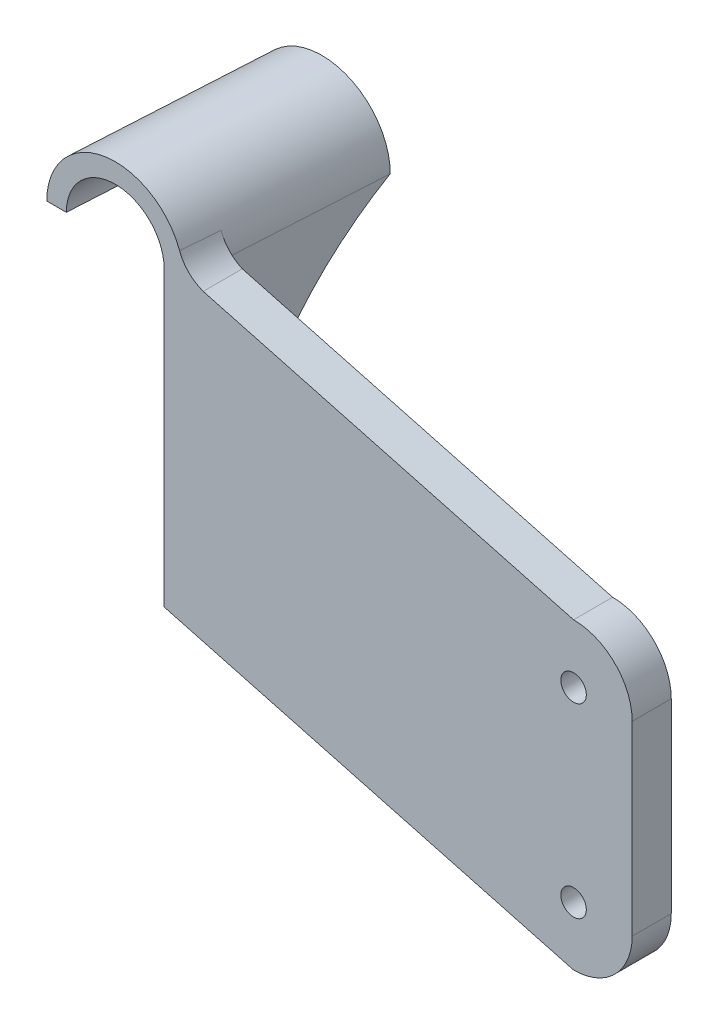
ISO-10303-21;
HEADER;
FILE_DESCRIPTION(('STEP AP214'),'2;1');
FILE_NAME('part.step','',(''),(''),'','','');
FILE_SCHEMA(('AUTOMOTIVE_DESIGN { 1 0 10303 214 1 1 1 1 }'));
ENDSEC;
DATA;
#1=APPLICATION_CONTEXT('core data for automotive mechanical design processes');
#2=APPLICATION_PROTOCOL_DEFINITION('international standard','automotive_design',2000,#1);
#3=PRODUCT_CONTEXT('',#1,'mechanical');
#4=PRODUCT('Part','Part','',(#3));
#5=PRODUCT_RELATED_PRODUCT_CATEGORY('part','',(#4));
#6=PRODUCT_DEFINITION_FORMATION('','',#4);
#7=PRODUCT_DEFINITION_CONTEXT('part definition',#1,'design');
#8=PRODUCT_DEFINITION('design','',#6,#7);
#9=PRODUCT_DEFINITION_SHAPE('','',#8);
#10=(LENGTH_UNIT() NAMED_UNIT(*) SI_UNIT(.MILLI.,.METRE.));
#11=(NAMED_UNIT(*) PLANE_ANGLE_UNIT() SI_UNIT($,.RADIAN.));
#12=(NAMED_UNIT(*) SI_UNIT($,.STERADIAN.) SOLID_ANGLE_UNIT());
#13=UNCERTAINTY_MEASURE_WITH_UNIT(LENGTH_MEASURE(1.E-05),#10,'distance_accuracy_value','');
#14=(GEOMETRIC_REPRESENTATION_CONTEXT(3) GLOBAL_UNCERTAINTY_ASSIGNED_CONTEXT((#13)) GLOBAL_UNIT_ASSIGNED_CONTEXT((#10,
#11,#12)) REPRESENTATION_CONTEXT('',''));
#15=CARTESIAN_POINT('',(0.,0.,0.));
#16=DIRECTION('',(0.,0.,1.));
#17=DIRECTION('',(1.,0.,0.));
#18=AXIS2_PLACEMENT_3D('',#15,#16,#17);
#19=CARTESIAN_POINT('',(0.,0.,0.));
#20=DIRECTION('',(0.,0.,1.));
#21=DIRECTION('',(1.,0.,0.));
#22=AXIS2_PLACEMENT_3D('',#19,#20,#21);
#23=PLANE('',#22);
#24=CARTESIAN_POINT('',(-15.,-23.8125,0.));
#25=DIRECTION('',(0.,0.,1.));
#26=DIRECTION('',(1.,0.,0.));
#27=AXIS2_PLACEMENT_3D('',#24,#25,#26);
#28=CIRCLE('',#27,3.2639);
#29=CARTESIAN_POINT('',(-11.7361,-23.8125,0.));
#30=VERTEX_POINT('',#29);
#31=EDGE_CURVE('E240',#30,#30,#28,.F.);
#32=ORIENTED_EDGE('',*,*,#31,.F.);
#33=EDGE_LOOP('',(#32));
#34=FACE_BOUND('',#33,.T.);
#35=CARTESIAN_POINT('',(-15.,23.8125,0.));
#36=DIRECTION('',(0.,0.,1.));
#37=DIRECTION('',(1.,0.,0.));
#38=AXIS2_PLACEMENT_3D('',#35,#36,#37);
#39=CIRCLE('',#38,3.2639);
#40=CARTESIAN_POINT('',(-11.7361,23.8125,0.));
#41=VERTEX_POINT('',#40);
#42=EDGE_CURVE('E268',#41,#41,#39,.T.);
#43=ORIENTED_EDGE('',*,*,#42,.T.);
#44=EDGE_LOOP('',(#43));
#45=FACE_BOUND('',#44,.T.);
#46=DIRECTION('',(0.,1.,0.));
#47=VECTOR('',#46,1.);
#48=CARTESIAN_POINT('',(-114.198978093451,-53.2440936926434,0.));
#49=LINE('',#48,#47);
#50=CARTESIAN_POINT('',(-114.198978093451,-12.2322139298705,0.));
#51=VERTEX_POINT('',#50);
#52=CARTESIAN_POINT('',(-114.198978093451,-9.1224517524588,0.));
#53=VERTEX_POINT('',#52);
#54=EDGE_CURVE('E182',#51,#53,#49,.T.);
#55=ORIENTED_EDGE('',*,*,#54,.T.);
#56=CARTESIAN_POINT('',(-114.198978093451,64.2083159442407,0.));
#57=VERTEX_POINT('',#56);
#58=EDGE_CURVE('E196',#53,#57,#49,.T.);
#59=ORIENTED_EDGE('',*,*,#58,.T.);
#60=CARTESIAN_POINT('',(-131.72751770729,64.2083159442407,0.));
#61=DIRECTION('',(0.,0.,1.));
#62=DIRECTION('',(-1.,0.,0.));
#63=AXIS2_PLACEMENT_3D('',#60,#61,#62);
#64=ELLIPSE('',#63,17.5285396138397,17.5);
#65=CARTESIAN_POINT('',(-115.202236813019,70.0438647685337,0.));
#66=VERTEX_POINT('',#65);
#67=EDGE_CURVE('E103',#66,#57,#64,.F.);
#68=ORIENTED_EDGE('',*,*,#67,.F.);
#69=CARTESIAN_POINT('',(-116.766052143577,70.3934678805941,25.1294023386461));
#70=CARTESIAN_POINT('',(-114.90583972174,65.4489533344291,25.3216426303527));
#71=CARTESIAN_POINT('',(-109.778475403574,64.2083159442407,25.6629997691564));
#72=CARTESIAN_POINT('',(-116.66491568588,70.377357883688,23.4659424467528));
#73=CARTESIAN_POINT('',(-114.831989143142,65.4893471285427,23.664285742457));
#74=CARTESIAN_POINT('',(-109.778475403574,64.2083159442407,23.9997382471047));
#75=CARTESIAN_POINT('',(-116.563339357471,70.360009460471,21.802541514051));
#76=CARTESIAN_POINT('',(-114.757622786703,65.5283220216384,22.0025928008072));
#77=CARTESIAN_POINT('',(-109.778475403574,64.2083159442407,22.336550108114));
#78=CARTESIAN_POINT('',(-116.359273757942,70.322660467848,18.4758729858612));
#79=CARTESIAN_POINT('',(-114.608224110674,65.6031364219687,18.679450362724));
#80=CARTESIAN_POINT('',(-109.778475403574,64.2083159442407,19.0103371241911));
#81=CARTESIAN_POINT('',(-116.256784485736,70.3026598952825,16.8126053905344));
#82=CARTESIAN_POINT('',(-114.533187651559,65.6389953145911,17.0178336438794));
#83=CARTESIAN_POINT('',(-109.778475403574,64.2083159442407,17.3473122794558));
#84=CARTESIAN_POINT('',(-115.947907106273,70.2384190068275,11.8231817802251));
#85=CARTESIAN_POINT('',(-114.307599852585,65.7415402474603,12.0456433147462));
#86=CARTESIAN_POINT('',(-109.778475403574,64.2083159442407,12.3586634958358));
#87=CARTESIAN_POINT('',(-115.740100314983,70.1899380979417,8.49725481725506));
#88=CARTESIAN_POINT('',(-114.155438690391,65.8038104631074,8.7223430488615));
#89=CARTESIAN_POINT('',(-109.778475403574,64.2083159442407,9.03331520158085));
#90=CARTESIAN_POINT('',(-115.320415583674,70.079878430995,1.84617846887328));
#91=CARTESIAN_POINT('',(-113.848163464536,65.914855266847,2.07762500042309));
#92=CARTESIAN_POINT('',(-109.778475403574,64.2083159442407,2.38353011946709));
#93=CARTESIAN_POINT('',(-115.108537593924,70.0182995128474,-1.47897090653729));
#94=CARTESIAN_POINT('',(-113.693020250072,65.9637736605168,-1.24502475761192));
#95=CARTESIAN_POINT('',(-109.778475403574,64.2083159442407,-0.940906656753593));
#96=CARTESIAN_POINT('',(-114.787431207845,69.9142746202379,-6.4659182219596));
#97=CARTESIAN_POINT('',(-113.457403421985,66.0263332277125,-6.23831757967811));
#98=CARTESIAN_POINT('',(-109.778475403574,64.2083159442407,-5.92667658565525));
#99=CARTESIAN_POINT('',(-114.679845092063,69.8776559629821,-8.12814135631387));
#100=CARTESIAN_POINT('',(-113.378632185065,66.045341914572,-7.89908801186984));
#101=CARTESIAN_POINT('',(-109.778475403574,64.2083159442407,-7.58848916624825));
#102=CARTESIAN_POINT('',(-114.46353560071,69.8001233123855,-11.452257768302));
#103=CARTESIAN_POINT('',(-113.220260350629,66.0795208521239,-11.2201863646433));
#104=CARTESIAN_POINT('',(-109.778475403574,64.2083159442407,-10.9117468487779));
#105=CARTESIAN_POINT('',(-114.35481222144,69.7592093050731,-13.1141510448453));
#106=CARTESIAN_POINT('',(-113.140656536688,66.0947088612405,-12.8806574873745));
#107=CARTESIAN_POINT('',(-109.778475403574,64.2083159442407,-12.5731919495016));
#108=CARTESIAN_POINT('',(-114.245499421827,69.7159427404333,-14.7758508051952));
#109=CARTESIAN_POINT('',(-113.060456799944,66.1079038082248,-14.5443255332637));
#110=CARTESIAN_POINT('',(-109.778475403574,64.2083159442407,-14.2344239933561));
#111=(BOUNDED_SURFACE() B_SPLINE_SURFACE(3,2,((#69,#70,#71),(#72,#73,#74),(#75,#76,#77),(#78,
#79,#80),(#81,#82,#83),(#84,#85,#86),(#87,#88,#89),(#90,#91,#92),(#93,#94,#95),(#96,#97,#98),
(#99,#100,#101),(#102,#103,#104),(#105,#106,#107),(#108,#109,#110)),.UNSPECIFIED.,.F.,.F.,
.F.) B_SPLINE_SURFACE_WITH_KNOTS((4,2,2,2,2,2,4),(3,3),(0.,5.00021829313843,10.0004425433833,
20.0004397944228,30.0005592747061,35.0008405975528,40.0011381852948),(0.,1.),
.UNSPECIFIED.) GEOMETRIC_REPRESENTATION_ITEM() RATIONAL_B_SPLINE_SURFACE(((1.,0.884071462904654,
1.),(1.,0.886351297895183,1.),(1.,0.888608283563405,1.),(1.,0.89307753883121,1.),(1.,
0.895289808377516,1.),(1.,0.901860810961567,1.),(1.,0.906153943513278,1.),(1.,0.914572416122216,
1.),(1.,0.918697754127885,1.),(1.,0.924764693748891,1.),(1.,0.926766872077972,1.),(1.,
0.930731559444101,1.),(1.,0.932694068352093,1.),(1.,0.934637096018605,1.))) REPRESENTATION_ITEM('') SURFACE());
#112=CARTESIAN_POINT('',(-115.202236813019,70.0438647685337,0.));
#113=CARTESIAN_POINT('',(-115.108132982728,69.7781646984082,0.));
#114=CARTESIAN_POINT('',(-115.002755626731,69.5164646709673,0.));
#115=CARTESIAN_POINT('',(-114.770340667487,69.0028740436337,0.));
#116=CARTESIAN_POINT('',(-114.643303657801,68.7509831751628,0.));
#117=CARTESIAN_POINT('',(-114.368416159062,68.2587431651938,0.));
#118=CARTESIAN_POINT('',(-114.220560410257,68.0183969610417,0.));
#119=CARTESIAN_POINT('',(-113.90514638744,67.5510156357587,0.));
#120=CARTESIAN_POINT('',(-113.737588937366,67.3239799585665,0.));
#121=CARTESIAN_POINT('',(-113.383837064143,66.8846813899946,0.));
#122=CARTESIAN_POINT('',(-113.19763059241,66.6724282012197,0.));
#123=CARTESIAN_POINT('',(-112.80801718424,66.2643435079565,0.));
#124=CARTESIAN_POINT('',(-112.604610260098,66.0685119917303,0.));
#125=CARTESIAN_POINT('',(-112.182348371897,65.6949339322396,0.));
#126=CARTESIAN_POINT('',(-111.963516266534,65.5171615432337,0.));
#127=CARTESIAN_POINT('',(-111.511784692074,65.1806781699171,0.));
#128=CARTESIAN_POINT('',(-111.278891067782,65.0219593466787,0.));
#129=CARTESIAN_POINT('',(-110.837619076165,64.7476562559938,0.));
#130=CARTESIAN_POINT('',(-110.631020585502,64.6291973896918,0.));
#131=CARTESIAN_POINT('',(-110.21023628918,64.4073709349515,0.));
#132=CARTESIAN_POINT('',(-109.996061256318,64.3039829111614,0.));
#133=CARTESIAN_POINT('',(-109.778475403574,64.2083159442407,0.));
#134=B_SPLINE_CURVE_WITH_KNOTS('',3,(#112,#113,#114,#115,#116,#117,#118,#119,#120,#121,#122,
#123,#124,#125,#126,#127,#128,#129,#130,#131,#132,#133),.UNSPECIFIED.,.F.,.F.,(4,2,2,2,2,2,2,2,
2,2,4),(0.,0.845356906713638,1.69069065095905,2.53623834909512,3.38175069837819,
4.22781287598424,5.07387444883638,5.91870757733214,6.76319192865767,7.47705665536603,
8.18994422678877),.UNSPECIFIED.);
#135=CARTESIAN_POINT('',(-109.778475403574,64.2083159442407,0.));
#136=VERTEX_POINT('',#135);
#137=EDGE_CURVE('E12',#66,#136,#134,.T.);
#138=ORIENTED_EDGE('',*,*,#137,.T.);
#139=DIRECTION('',(-0.965925826289068,0.258819045102521,0.));
#140=VECTOR('',#139,1.);
#141=CARTESIAN_POINT('',(8.6983155283833,32.4625554921917,0.));
#142=LINE('',#141,#140);
#143=CARTESIAN_POINT('',(-15.,38.8125,0.));
#144=VERTEX_POINT('',#143);
#145=EDGE_CURVE('E264',#144,#136,#142,.T.);
#146=ORIENTED_EDGE('',*,*,#145,.F.);
#147=CARTESIAN_POINT('',(-15.,23.8125,0.));
#148=DIRECTION('',(0.,0.,1.));
#149=DIRECTION('',(1.,0.,0.));
#150=AXIS2_PLACEMENT_3D('',#147,#148,#149);
#151=CIRCLE('',#150,15.);
#152=CARTESIAN_POINT('',(0.,23.8125,0.));
#153=VERTEX_POINT('',#152);
#154=EDGE_CURVE('E262',#153,#144,#151,.T.);
#155=ORIENTED_EDGE('',*,*,#154,.F.);
#156=DIRECTION('',(0.,1.,0.));
#157=VECTOR('',#156,1.);
#158=CARTESIAN_POINT('',(0.,0.,0.));
#159=LINE('',#158,#157);
#160=CARTESIAN_POINT('',(0.,-23.8125,0.));
#161=VERTEX_POINT('',#160);
#162=EDGE_CURVE('E260',#161,#153,#159,.T.);
#163=ORIENTED_EDGE('',*,*,#162,.F.);
#164=CARTESIAN_POINT('',(-15.,-23.8125,0.));
#165=DIRECTION('',(0.,0.,1.));
#166=DIRECTION('',(1.,0.,0.));
#167=AXIS2_PLACEMENT_3D('',#164,#165,#166);
#168=CIRCLE('',#167,15.);
#169=CARTESIAN_POINT('',(-15.,-38.8125,0.));
#170=VERTEX_POINT('',#169);
#171=EDGE_CURVE('E235',#161,#170,#168,.F.);
#172=ORIENTED_EDGE('',*,*,#171,.T.);
#173=DIRECTION('',(-0.965925826289068,0.258819045102521,0.));
#174=VECTOR('',#173,1.);
#175=CARTESIAN_POINT('',(-10.7079344716167,-39.9625554921918,0.));
#176=LINE('',#175,#174);
#177=EDGE_CURVE('E203',#170,#51,#176,.T.);
#178=ORIENTED_EDGE('',*,*,#177,.T.);
#179=EDGE_LOOP('',(#55,#59,#68,#138,#146,#155,#163,#172,#178));
#180=FACE_BOUND('',#179,.T.);
#181=ADVANCED_FACE('F84',(#34,#45,#180),#23,.F.);
#182=CARTESIAN_POINT('',(0.,0.,10.));
#183=DIRECTION('',(0.,0.,1.));
#184=DIRECTION('',(1.,0.,0.));
#185=AXIS2_PLACEMENT_3D('',#182,#183,#184);
#186=PLANE('',#185);
#187=CARTESIAN_POINT('',(-132.298860842031,64.2083159442407,10.));
#188=DIRECTION('',(0.,0.,1.));
#189=DIRECTION('',(-1.,0.,0.));
#190=AXIS2_PLACEMENT_3D('',#187,#188,#189);
#191=ELLIPSE('',#190,12.5203854384569,12.5);
#192=CARTESIAN_POINT('',(-119.778475403574,64.2083159442407,9.99999999999976));
#193=VERTEX_POINT('',#192);
#194=CARTESIAN_POINT('',(-144.819246280488,64.2083159442407,9.99999999999999));
#195=VERTEX_POINT('',#194);
#196=EDGE_CURVE('E218',#193,#195,#191,.T.);
#197=ORIENTED_EDGE('',*,*,#196,.F.);
#198=DIRECTION('',(0.,1.,0.));
#199=VECTOR('',#198,1.);
#200=CARTESIAN_POINT('',(-119.778475403574,0.,10.));
#201=LINE('',#200,#199);
#202=CARTESIAN_POINT('',(-119.778475403574,-10.737192131448,9.99999999999976));
#203=VERTEX_POINT('',#202);
#204=EDGE_CURVE('E246',#203,#193,#201,.T.);
#205=ORIENTED_EDGE('',*,*,#204,.F.);
#206=DIRECTION('',(-0.965925826289068,0.258819045102521,0.));
#207=VECTOR('',#206,1.);
#208=CARTESIAN_POINT('',(-10.7079344716167,-39.9625554921918,10.));
#209=LINE('',#208,#207);
#210=CARTESIAN_POINT('',(-15.,-38.8125,10.));
#211=VERTEX_POINT('',#210);
#212=EDGE_CURVE('E249',#211,#203,#209,.T.);
#213=ORIENTED_EDGE('',*,*,#212,.F.);
#214=CARTESIAN_POINT('',(-15.,-23.8125,10.));
#215=DIRECTION('',(0.,0.,1.));
#216=DIRECTION('',(1.,0.,0.));
#217=AXIS2_PLACEMENT_3D('',#214,#215,#216);
#218=CIRCLE('',#217,15.);
#219=CARTESIAN_POINT('',(0.,-23.8125,10.));
#220=VERTEX_POINT('',#219);
#221=EDGE_CURVE('E236',#220,#211,#218,.F.);
#222=ORIENTED_EDGE('',*,*,#221,.F.);
#223=DIRECTION('',(0.,1.,0.));
#224=VECTOR('',#223,1.);
#225=CARTESIAN_POINT('',(0.,0.,10.));
#226=LINE('',#225,#224);
#227=CARTESIAN_POINT('',(0.,23.8125,10.));
#228=VERTEX_POINT('',#227);
#229=EDGE_CURVE('E239',#220,#228,#226,.T.);
#230=ORIENTED_EDGE('',*,*,#229,.T.);
#231=CARTESIAN_POINT('',(-15.,23.8125,10.));
#232=DIRECTION('',(0.,0.,1.));
#233=DIRECTION('',(1.,0.,0.));
#234=AXIS2_PLACEMENT_3D('',#231,#232,#233);
#235=CIRCLE('',#234,15.);
#236=CARTESIAN_POINT('',(-15.,38.8125,10.));
#237=VERTEX_POINT('',#236);
#238=EDGE_CURVE('E242',#228,#237,#235,.T.);
#239=ORIENTED_EDGE('',*,*,#238,.T.);
#240=DIRECTION('',(-0.965925826289068,0.258819045102521,0.));
#241=VECTOR('',#240,1.);
#242=CARTESIAN_POINT('',(8.6983155283833,32.4625554921917,10.));
#243=LINE('',#242,#241);
#244=CARTESIAN_POINT('',(-109.778475403574,64.2083159442407,10.));
#245=VERTEX_POINT('',#244);
#246=EDGE_CURVE('E244',#237,#245,#243,.T.);
#247=ORIENTED_EDGE('',*,*,#246,.T.);
#248=CARTESIAN_POINT('',(-109.778475403574,64.2083159442407,10.));
#249=CARTESIAN_POINT('',(-110.04446235349,64.3031228434152,10.));
#250=CARTESIAN_POINT('',(-110.306429598982,64.4091923337721,10.));
#251=CARTESIAN_POINT('',(-110.82051056026,64.6429850482996,10.));
#252=CARTESIAN_POINT('',(-111.072624483562,64.7707078161386,10.));
#253=CARTESIAN_POINT('',(-111.565134770727,65.046905345347,10.));
#254=CARTESIAN_POINT('',(-111.80553403408,65.1953749361277,10.));
#255=CARTESIAN_POINT('',(-112.272969988109,65.5120217924653,10.));
#256=CARTESIAN_POINT('',(-112.500007155843,65.6801983537925,10.));
#257=CARTESIAN_POINT('',(-112.939272744247,66.0352238648214,10.));
#258=CARTESIAN_POINT('',(-113.151489549661,66.2220871871793,10.));
#259=CARTESIAN_POINT('',(-113.559408660405,66.6130430774603,10.));
#260=CARTESIAN_POINT('',(-113.755110934637,66.8171356778259,10.));
#261=CARTESIAN_POINT('',(-114.128411461639,67.2409063891312,10.));
#262=CARTESIAN_POINT('',(-114.306027438163,67.4605688770795,10.));
#263=CARTESIAN_POINT('',(-114.642040428866,67.9139999385939,10.));
#264=CARTESIAN_POINT('',(-114.800442959505,68.1477644342672,10.));
#265=CARTESIAN_POINT('',(-115.126533478059,68.6757482837888,10.));
#266=CARTESIAN_POINT('',(-115.289786240726,68.9727347003004,10.));
#267=CARTESIAN_POINT('',(-115.511366398438,69.4291748212543,10.));
#268=CARTESIAN_POINT('',(-115.581323699089,69.5830947465783,10.));
#269=CARTESIAN_POINT('',(-115.713355383002,69.8942746293057,10.));
#270=CARTESIAN_POINT('',(-115.775429966112,70.0515345019146,10.));
#271=CARTESIAN_POINT('',(-115.833493215029,70.2102969851652,10.));
#272=B_SPLINE_CURVE_WITH_KNOTS('',3,(#248,#249,#250,#251,#252,#253,#254,#255,#256,#257,#258,
#259,#260,#261,#262,#263,#264,#265,#266,#267,#268,#269,#270,#271),.UNSPECIFIED.,.F.,.F.,(4,2,2,
2,2,2,2,2,2,2,2,4),(0.,0.846877319699284,1.69373679410729,2.54038558670004,3.38700413347242,
4.23427892762304,5.0815553172228,5.92799325797238,6.77418759584909,7.78893401206252,
8.29596676716393,8.80298666507999),.UNSPECIFIED.);
#273=CARTESIAN_POINT('',(-115.833493215029,70.2102969851653,10.));
#274=VERTEX_POINT('',#273);
#275=EDGE_CURVE('E96',#245,#274,#272,.T.);
#276=ORIENTED_EDGE('',*,*,#275,.T.);
#277=CARTESIAN_POINT('',(-132.298860842031,64.2083159442407,10.));
#278=DIRECTION('',(0.,0.,1.));
#279=DIRECTION('',(-1.,0.,0.));
#280=AXIS2_PLACEMENT_3D('',#277,#278,#279);
#281=ELLIPSE('',#280,17.5285396138397,17.5);
#282=CARTESIAN_POINT('',(-149.827400455871,64.2083159442407,9.99999999999999));
#283=VERTEX_POINT('',#282);
#284=EDGE_CURVE('E223',#274,#283,#281,.T.);
#285=ORIENTED_EDGE('',*,*,#284,.T.);
#286=DIRECTION('',(1.,0.,0.));
#287=VECTOR('',#286,1.);
#288=CARTESIAN_POINT('',(-165.74301662356,64.2083159442407,10.));
#289=LINE('',#288,#287);
#290=EDGE_CURVE('E226',#283,#195,#289,.T.);
#291=ORIENTED_EDGE('',*,*,#290,.T.);
#292=EDGE_LOOP('',(#197,#205,#213,#222,#230,#239,#247,#276,#285,#291));
#293=FACE_BOUND('',#292,.T.);
#294=CARTESIAN_POINT('',(-15.,23.8125,10.));
#295=DIRECTION('',(0.,0.,1.));
#296=DIRECTION('',(1.,0.,0.));
#297=AXIS2_PLACEMENT_3D('',#294,#295,#296);
#298=CIRCLE('',#297,3.2639);
#299=CARTESIAN_POINT('',(-11.7361,23.8125,10.));
#300=VERTEX_POINT('',#299);
#301=EDGE_CURVE('E252',#300,#300,#298,.T.);
#302=ORIENTED_EDGE('',*,*,#301,.F.);
#303=EDGE_LOOP('',(#302));
#304=FACE_BOUND('',#303,.T.);
#305=CARTESIAN_POINT('',(-15.,-23.8125,10.));
#306=DIRECTION('',(0.,0.,1.));
#307=DIRECTION('',(1.,0.,0.));
#308=AXIS2_PLACEMENT_3D('',#305,#306,#307);
#309=CIRCLE('',#308,3.2639);
#310=CARTESIAN_POINT('',(-11.7361,-23.8125,10.));
#311=VERTEX_POINT('',#310);
#312=EDGE_CURVE('E255',#311,#311,#309,.F.);
#313=ORIENTED_EDGE('',*,*,#312,.T.);
#314=EDGE_LOOP('',(#313));
#315=FACE_BOUND('',#314,.T.);
#316=ADVANCED_FACE('F330',(#293,#304,#315),#186,.T.);
#317=CARTESIAN_POINT('',(-165.74301662356,64.2083159442407,-40.));
#318=DIRECTION('',(0.,-1.,0.));
#319=DIRECTION('',(0.,0.,-1.));
#320=AXIS2_PLACEMENT_3D('',#317,#318,#319);
#321=PLANE('',#320);
#322=DIRECTION('',(-0.0570412885398924,0.,0.99837182021615));
#323=VECTOR('',#322,1.);
#324=CARTESIAN_POINT('',(-141.500625900315,64.2083159442407,-48.0845411169636));
#325=LINE('',#324,#323);
#326=CARTESIAN_POINT('',(-141.962530606785,64.2083159442407,-40.));
#327=VERTEX_POINT('',#326);
#328=EDGE_CURVE('E211',#327,#195,#325,.T.);
#329=ORIENTED_EDGE('',*,*,#328,.T.);
#330=ORIENTED_EDGE('',*,*,#290,.F.);
#331=DIRECTION('',(-0.0570412885398924,0.,0.99837182021615));
#332=VECTOR('',#331,1.);
#333=CARTESIAN_POINT('',(-146.492485001395,64.2083159442407,-48.369747559663));
#334=LINE('',#333,#332);
#335=CARTESIAN_POINT('',(-146.970684782168,64.2083159442407,-40.));
#336=VERTEX_POINT('',#335);
#337=EDGE_CURVE('E220',#336,#283,#334,.T.);
#338=ORIENTED_EDGE('',*,*,#337,.F.);
#339=DIRECTION('',(1.,0.,0.));
#340=VECTOR('',#339,1.);
#341=CARTESIAN_POINT('',(-165.74301662356,64.2083159442407,-40.));
#342=LINE('',#341,#340);
#343=EDGE_CURVE('E227',#336,#327,#342,.T.);
#344=ORIENTED_EDGE('',*,*,#343,.T.);
#345=EDGE_LOOP('',(#329,#330,#338,#344));
#346=FACE_BOUND('',#345,.T.);
#347=ADVANCED_FACE('F361',(#346),#321,.T.);
#348=CARTESIAN_POINT('',(0.,0.,-40.));
#349=DIRECTION('',(0.,0.,1.));
#350=DIRECTION('',(1.,0.,0.));
#351=AXIS2_PLACEMENT_3D('',#348,#349,#350);
#352=PLANE('',#351);
#353=CARTESIAN_POINT('',(-129.442145168328,64.2083159442407,-40.));
#354=DIRECTION('',(0.,0.,1.));
#355=DIRECTION('',(-1.,0.,0.));
#356=AXIS2_PLACEMENT_3D('',#353,#354,#355);
#357=ELLIPSE('',#356,17.5285396138397,17.5);
#358=CARTESIAN_POINT('',(-111.913605554488,64.2083159442407,-40.));
#359=VERTEX_POINT('',#358);
#360=EDGE_CURVE('E282',#359,#336,#357,.T.);
#361=ORIENTED_EDGE('',*,*,#360,.F.);
#362=CARTESIAN_POINT('',(763.265329820694,-10.6773328411647,-40.));
#363=DIRECTION('',(0.,0.,1.));
#364=DIRECTION('',(1.,0.,0.));
#365=AXIS2_PLACEMENT_3D('',#362,#363,#364);
#366=ELLIPSE('',#365,1577.80446942494,90.);
#367=CARTESIAN_POINT('',(-116.921759729871,64.017088464631,-40.));
#368=VERTEX_POINT('',#367);
#369=EDGE_CURVE('E191',#359,#368,#366,.T.);
#370=ORIENTED_EDGE('',*,*,#369,.T.);
#371=DIRECTION('',(0.,1.,0.));
#372=VECTOR('',#371,1.);
#373=CARTESIAN_POINT('',(-116.921759729871,-53.2440936926434,-40.));
#374=LINE('',#373,#372);
#375=CARTESIAN_POINT('',(-116.921759729871,64.2083159442407,-40.));
#376=VERTEX_POINT('',#375);
#377=EDGE_CURVE('E204',#368,#376,#374,.T.);
#378=ORIENTED_EDGE('',*,*,#377,.T.);
#379=CARTESIAN_POINT('',(-129.442145168328,64.2083159442407,-40.));
#380=DIRECTION('',(0.,0.,1.));
#381=DIRECTION('',(-1.,0.,0.));
#382=AXIS2_PLACEMENT_3D('',#379,#380,#381);
#383=ELLIPSE('',#382,12.5203854384569,12.5);
#384=EDGE_CURVE('E214',#376,#327,#383,.T.);
#385=ORIENTED_EDGE('',*,*,#384,.T.);
#386=ORIENTED_EDGE('',*,*,#343,.F.);
#387=EDGE_LOOP('',(#361,#370,#378,#385,#386));
#388=FACE_BOUND('',#387,.T.);
#389=ADVANCED_FACE('F309',(#388),#352,.F.);
#390=CARTESIAN_POINT('',(-15.,-23.8125,10.));
#391=DIRECTION('',(0.,0.,-1.));
#392=DIRECTION('',(-1.,0.,0.));
#393=AXIS2_PLACEMENT_3D('',#390,#391,#392);
#394=CYLINDRICAL_SURFACE('',#393,15.);
#395=ORIENTED_EDGE('',*,*,#171,.F.);
#396=DIRECTION('',(0.,0.,-1.));
#397=VECTOR('',#396,1.);
#398=CARTESIAN_POINT('',(0.,-23.8125,10.));
#399=LINE('',#398,#397);
#400=EDGE_CURVE('E280',#220,#161,#399,.T.);
#401=ORIENTED_EDGE('',*,*,#400,.F.);
#402=ORIENTED_EDGE('',*,*,#221,.T.);
#403=DIRECTION('',(0.,0.,-1.));
#404=VECTOR('',#403,1.);
#405=CARTESIAN_POINT('',(-15.,-38.8125,10.));
#406=LINE('',#405,#404);
#407=EDGE_CURVE('E258',#211,#170,#406,.T.);
#408=ORIENTED_EDGE('',*,*,#407,.T.);
#409=EDGE_LOOP('',(#395,#401,#402,#408));
#410=FACE_BOUND('',#409,.T.);
#411=ADVANCED_FACE('F354',(#410),#394,.T.);
#412=CARTESIAN_POINT('',(0.,0.,10.));
#413=DIRECTION('',(-1.,0.,0.));
#414=DIRECTION('',(0.,0.,1.));
#415=AXIS2_PLACEMENT_3D('',#412,#413,#414);
#416=PLANE('',#415);
#417=ORIENTED_EDGE('',*,*,#162,.T.);
#418=DIRECTION('',(0.,0.,-1.));
#419=VECTOR('',#418,1.);
#420=CARTESIAN_POINT('',(0.,23.8125,10.));
#421=LINE('',#420,#419);
#422=EDGE_CURVE('E277',#228,#153,#421,.T.);
#423=ORIENTED_EDGE('',*,*,#422,.F.);
#424=ORIENTED_EDGE('',*,*,#229,.F.);
#425=ORIENTED_EDGE('',*,*,#400,.T.);
#426=EDGE_LOOP('',(#417,#423,#424,#425));
#427=FACE_BOUND('',#426,.T.);
#428=ADVANCED_FACE('F351',(#427),#416,.F.);
#429=CARTESIAN_POINT('',(-15.,23.8125,10.));
#430=DIRECTION('',(0.,0.,-1.));
#431=DIRECTION('',(-1.,0.,0.));
#432=AXIS2_PLACEMENT_3D('',#429,#430,#431);
#433=CYLINDRICAL_SURFACE('',#432,15.);
#434=ORIENTED_EDGE('',*,*,#154,.T.);
#435=DIRECTION('',(0.,0.,-1.));
#436=VECTOR('',#435,1.);
#437=CARTESIAN_POINT('',(-15.,38.8125,10.));
#438=LINE('',#437,#436);
#439=EDGE_CURVE('E274',#237,#144,#438,.T.);
#440=ORIENTED_EDGE('',*,*,#439,.F.);
#441=ORIENTED_EDGE('',*,*,#238,.F.);
#442=ORIENTED_EDGE('',*,*,#422,.T.);
#443=EDGE_LOOP('',(#434,#440,#441,#442));
#444=FACE_BOUND('',#443,.T.);
#445=ADVANCED_FACE('F347',(#444),#433,.T.);
#446=CARTESIAN_POINT('',(8.6983155283833,32.4625554921917,10.));
#447=DIRECTION('',(-0.258819045102521,-0.965925826289068,0.));
#448=DIRECTION('',(0.965925826289068,-0.258819045102521,0.));
#449=AXIS2_PLACEMENT_3D('',#446,#447,#448);
#450=PLANE('',#449);
#451=ORIENTED_EDGE('',*,*,#145,.T.);
#452=DIRECTION('',(0.,0.,1.));
#453=VECTOR('',#452,1.);
#454=CARTESIAN_POINT('',(-109.778475403574,64.2083159442407,-40.));
#455=LINE('',#454,#453);
#456=EDGE_CURVE('E230',#136,#245,#455,.T.);
#457=ORIENTED_EDGE('',*,*,#456,.T.);
#458=ORIENTED_EDGE('',*,*,#246,.F.);
#459=ORIENTED_EDGE('',*,*,#439,.T.);
#460=EDGE_LOOP('',(#451,#457,#458,#459));
#461=FACE_BOUND('',#460,.T.);
#462=ADVANCED_FACE('F340',(#461),#450,.F.);
#463=CARTESIAN_POINT('',(-15.,23.8125,10.));
#464=DIRECTION('',(0.,0.,-1.));
#465=DIRECTION('',(-1.,0.,0.));
#466=AXIS2_PLACEMENT_3D('',#463,#464,#465);
#467=CYLINDRICAL_SURFACE('',#466,3.2639);
#468=ORIENTED_EDGE('',*,*,#301,.T.);
#469=EDGE_LOOP('',(#468));
#470=FACE_BOUND('',#469,.T.);
#471=ORIENTED_EDGE('',*,*,#42,.F.);
#472=EDGE_LOOP('',(#471));
#473=FACE_BOUND('',#472,.T.);
#474=ADVANCED_FACE('F337',(#470,#473),#467,.F.);
#475=CARTESIAN_POINT('',(-10.7079344716167,-39.9625554921918,10.));
#476=DIRECTION('',(-0.258819045102521,-0.965925826289068,0.));
#477=DIRECTION('',(0.965925826289068,-0.258819045102521,0.));
#478=AXIS2_PLACEMENT_3D('',#475,#476,#477);
#479=PLANE('',#478);
#480=CARTESIAN_POINT('',(-120.001873316217,-10.6773328411647,-90.4648652653761));
#481=DIRECTION('',(-0.258819045102521,-0.965925826289068,0.));
#482=DIRECTION('',(0.964240505891296,-0.25836746486295,0.0590465909159068));
#483=AXIS2_PLACEMENT_3D('',#480,#481,#482);
#484=ELLIPSE('',#483,348.300393122854,90.);
#485=CARTESIAN_POINT('',(-119.191588458902,-10.8944480143213,-0.272057350239968));
#486=VERTEX_POINT('',#485);
#487=EDGE_CURVE('E368',#51,#486,#484,.T.);
#488=ORIENTED_EDGE('',*,*,#487,.F.);
#489=ORIENTED_EDGE('',*,*,#177,.F.);
#490=ORIENTED_EDGE('',*,*,#407,.F.);
#491=ORIENTED_EDGE('',*,*,#212,.T.);
#492=DIRECTION('',(-0.0570346271200015,0.0152823822774146,0.998255227935827));
#493=VECTOR('',#492,1.);
#494=CARTESIAN_POINT('',(-119.398200973654,-10.8390863578474,3.34420234010542));
#495=LINE('',#494,#493);
#496=EDGE_CURVE('E205',#486,#203,#495,.T.);
#497=ORIENTED_EDGE('',*,*,#496,.F.);
#498=EDGE_LOOP('',(#488,#489,#490,#491,#497));
#499=FACE_BOUND('',#498,.T.);
#500=ADVANCED_FACE('F335',(#499),#479,.T.);
#501=CARTESIAN_POINT('',(-15.,-23.8125,10.));
#502=DIRECTION('',(0.,0.,-1.));
#503=DIRECTION('',(-1.,0.,0.));
#504=AXIS2_PLACEMENT_3D('',#501,#502,#503);
#505=CYLINDRICAL_SURFACE('',#504,3.2639);
#506=ORIENTED_EDGE('',*,*,#312,.F.);
#507=EDGE_LOOP('',(#506));
#508=FACE_BOUND('',#507,.T.);
#509=ORIENTED_EDGE('',*,*,#31,.T.);
#510=EDGE_LOOP('',(#509));
#511=FACE_BOUND('',#510,.T.);
#512=ADVANCED_FACE('F305',(#508,#511),#505,.F.);
#513=CARTESIAN_POINT('',(-129.020978147613,64.2083159442407,-47.3715250102149));
#514=DIRECTION('',(-0.0570412885398924,0.,0.99837182021615));
#515=DIRECTION('',(0.99837182021615,0.,0.0570412885398924));
#516=AXIS2_PLACEMENT_3D('',#513,#514,#515);
#517=CYLINDRICAL_SURFACE('',#516,17.5);
#518=ORIENTED_EDGE('',*,*,#284,.F.);
#519=CARTESIAN_POINT('',(-116.766052143577,70.3934678805941,25.1294023386461));
#520=CARTESIAN_POINT('',(-116.66491568588,70.377357883688,23.4659424467528));
#521=CARTESIAN_POINT('',(-116.563339357471,70.360009460471,21.802541514051));
#522=CARTESIAN_POINT('',(-116.359273757942,70.3226604678481,18.4758729858612));
#523=CARTESIAN_POINT('',(-116.256784485736,70.3026598952825,16.8126053905344));
#524=CARTESIAN_POINT('',(-115.947907106273,70.2384190068276,11.8231817802251));
#525=CARTESIAN_POINT('',(-115.740100314983,70.1899380979417,8.49725481725506));
#526=CARTESIAN_POINT('',(-115.320415583674,70.079878430995,1.84617846887327));
#527=CARTESIAN_POINT('',(-115.108537593924,70.0182995128474,-1.47897090653729));
#528=CARTESIAN_POINT('',(-114.787431207845,69.9142746202379,-6.4659182219596));
#529=CARTESIAN_POINT('',(-114.679845092063,69.8776559629821,-8.12814135631387));
#530=CARTESIAN_POINT('',(-114.46353560071,69.8001233123855,-11.452257768302));
#531=CARTESIAN_POINT('',(-114.35481222144,69.7592093050731,-13.1141510448453));
#532=CARTESIAN_POINT('',(-114.245499421827,69.7159427404333,-14.7758508051952));
#533=B_SPLINE_CURVE_WITH_KNOTS('',3,(#519,#520,#521,#522,#523,#524,#525,#526,#527,#528,#529,
#530,#531,#532),.UNSPECIFIED.,.F.,.F.,(4,2,2,2,2,2,4),(0.,5.00021829313843,10.0004425433833,
20.0004397944228,30.0005592747061,35.0008405975528,40.0011381852948),.UNSPECIFIED.);
#534=EDGE_CURVE('E285',#274,#66,#533,.T.);
#535=ORIENTED_EDGE('',*,*,#534,.T.);
#536=ORIENTED_EDGE('',*,*,#67,.T.);
#537=DIRECTION('',(-0.0570412885398924,0.,0.99837182021615));
#538=VECTOR('',#537,1.);
#539=CARTESIAN_POINT('',(-111.54947129383,64.2083159442407,-46.3733024607668));
#540=LINE('',#539,#538);
#541=EDGE_CURVE('E198',#359,#57,#540,.T.);
#542=ORIENTED_EDGE('',*,*,#541,.F.);
#543=ORIENTED_EDGE('',*,*,#360,.T.);
#544=ORIENTED_EDGE('',*,*,#337,.T.);
#545=EDGE_LOOP('',(#518,#535,#536,#542,#543,#544));
#546=FACE_BOUND('',#545,.T.);
#547=ADVANCED_FACE('F299',(#546),#517,.T.);
#548=CARTESIAN_POINT('',(-129.020978147613,64.2083159442407,-47.3715250102149));
#549=DIRECTION('',(-0.0570412885398924,0.,0.99837182021615));
#550=DIRECTION('',(0.99837182021615,0.,0.0570412885398924));
#551=AXIS2_PLACEMENT_3D('',#548,#549,#550);
#552=CYLINDRICAL_SURFACE('',#551,12.5);
#553=ORIENTED_EDGE('',*,*,#196,.T.);
#554=ORIENTED_EDGE('',*,*,#328,.F.);
#555=ORIENTED_EDGE('',*,*,#384,.F.);
#556=DIRECTION('',(-0.0570412885398924,0.,0.99837182021615));
#557=VECTOR('',#556,1.);
#558=CARTESIAN_POINT('',(-116.541330394911,64.2083159442407,-46.6585089034663));
#559=LINE('',#558,#557);
#560=EDGE_CURVE('E210',#376,#193,#559,.T.);
#561=ORIENTED_EDGE('',*,*,#560,.T.);
#562=EDGE_LOOP('',(#553,#554,#555,#561));
#563=FACE_BOUND('',#562,.T.);
#564=ADVANCED_FACE('F304',(#563),#552,.F.);
#565=ORIENTED_EDGE('',*,*,#137,.F.);
#566=ORIENTED_EDGE('',*,*,#534,.F.);
#567=ORIENTED_EDGE('',*,*,#275,.F.);
#568=ORIENTED_EDGE('',*,*,#456,.F.);
#569=EDGE_LOOP('',(#565,#566,#567,#568));
#570=FACE_BOUND('',#569,.T.);
#571=ADVANCED_FACE('F312',(#570),#111,.F.);
#572=CARTESIAN_POINT('',(-119.207132268833,-38.8125,0.));
#573=DIRECTION('',(0.99837182021615,0.,0.0570412885398942));
#574=DIRECTION('',(0.0570412885398942,0.,-0.99837182021615));
#575=AXIS2_PLACEMENT_3D('',#572,#573,#574);
#576=PLANE('',#575);
#577=ORIENTED_EDGE('',*,*,#377,.F.);
#578=CARTESIAN_POINT('',(-114.057887428495,-10.6773328411647,-90.1252597123817));
#579=DIRECTION('',(0.99837182021615,0.,0.0570412885398942));
#580=DIRECTION('',(0.0570412885398942,0.,-0.99837182021615));
#581=AXIS2_PLACEMENT_3D('',#578,#579,#580);
#582=CIRCLE('',#581,90.);
#583=EDGE_CURVE('E195',#368,#486,#582,.T.);
#584=ORIENTED_EDGE('',*,*,#583,.T.);
#585=ORIENTED_EDGE('',*,*,#496,.T.);
#586=ORIENTED_EDGE('',*,*,#204,.T.);
#587=ORIENTED_EDGE('',*,*,#560,.F.);
#588=EDGE_LOOP('',(#577,#584,#585,#586,#587));
#589=FACE_BOUND('',#588,.T.);
#590=ADVANCED_FACE('F316',(#589),#576,.F.);
#591=CARTESIAN_POINT('',(-111.913605554488,-53.2440936926434,-40.));
#592=DIRECTION('',(-0.99837182021615,0.,-0.0570412885398925));
#593=DIRECTION('',(-0.0570412885398925,0.,0.99837182021615));
#594=AXIS2_PLACEMENT_3D('',#591,#592,#593);
#595=PLANE('',#594);
#596=ORIENTED_EDGE('',*,*,#58,.F.);
#597=CARTESIAN_POINT('',(-109.066028327415,-10.6773328411647,-89.8400532696823));
#598=DIRECTION('',(0.99837182021615,0.,0.0570412885398925));
#599=DIRECTION('',(0.0570412885398925,0.,-0.99837182021615));
#600=AXIS2_PLACEMENT_3D('',#597,#598,#599);
#601=CIRCLE('',#600,90.);
#602=EDGE_CURVE('E185',#359,#53,#601,.T.);
#603=ORIENTED_EDGE('',*,*,#602,.F.);
#604=ORIENTED_EDGE('',*,*,#541,.T.);
#605=EDGE_LOOP('',(#596,#603,#604));
#606=FACE_BOUND('',#605,.T.);
#607=ADVANCED_FACE('F197',(#606),#595,.F.);
#608=CARTESIAN_POINT('',(-109.066028327415,-10.6773328411647,-89.8400532696823));
#609=DIRECTION('',(0.99837182021615,0.,0.0570412885398925));
#610=DIRECTION('',(0.0570412885398925,0.,-0.99837182021615));
#611=AXIS2_PLACEMENT_3D('',#608,#609,#610);
#612=PLANE('',#611);
#613=EDGE_CURVE('E178',#53,#51,#601,.T.);
#614=ORIENTED_EDGE('',*,*,#613,.F.);
#615=ORIENTED_EDGE('',*,*,#54,.F.);
#616=EDGE_LOOP('',(#614,#615));
#617=FACE_BOUND('',#616,.T.);
#618=ADVANCED_FACE('F180',(#617),#612,.F.);
#619=CARTESIAN_POINT('',(-158.984619338222,-10.6773328411647,-92.6921176966769));
#620=DIRECTION('',(0.99837182021615,0.,0.0570412885398925));
#621=DIRECTION('',(0.0570412885398925,0.,-0.99837182021615));
#622=AXIS2_PLACEMENT_3D('',#619,#620,#621);
#623=CYLINDRICAL_SURFACE('',#622,90.);
#624=ORIENTED_EDGE('',*,*,#602,.T.);
#625=ORIENTED_EDGE('',*,*,#613,.T.);
#626=ORIENTED_EDGE('',*,*,#487,.T.);
#627=ORIENTED_EDGE('',*,*,#583,.F.);
#628=ORIENTED_EDGE('',*,*,#369,.F.);
#629=EDGE_LOOP('',(#624,#625,#626,#627,#628));
#630=FACE_BOUND('',#629,.T.);
#631=ADVANCED_FACE('F189',(#630),#623,.F.);
#632=CLOSED_SHELL('',(#181,#316,#347,#389,#411,#428,#445,#462,#474,#500,#512,#547,#564,#571,
#590,#607,#618,#631));
#633=MANIFOLD_SOLID_BREP('B2',#632);
#634=ADVANCED_BREP_SHAPE_REPRESENTATION('',(#18,#633),#14);
#635=SHAPE_DEFINITION_REPRESENTATION(#9,#634);
ENDSEC;
END-ISO-10303-21;
